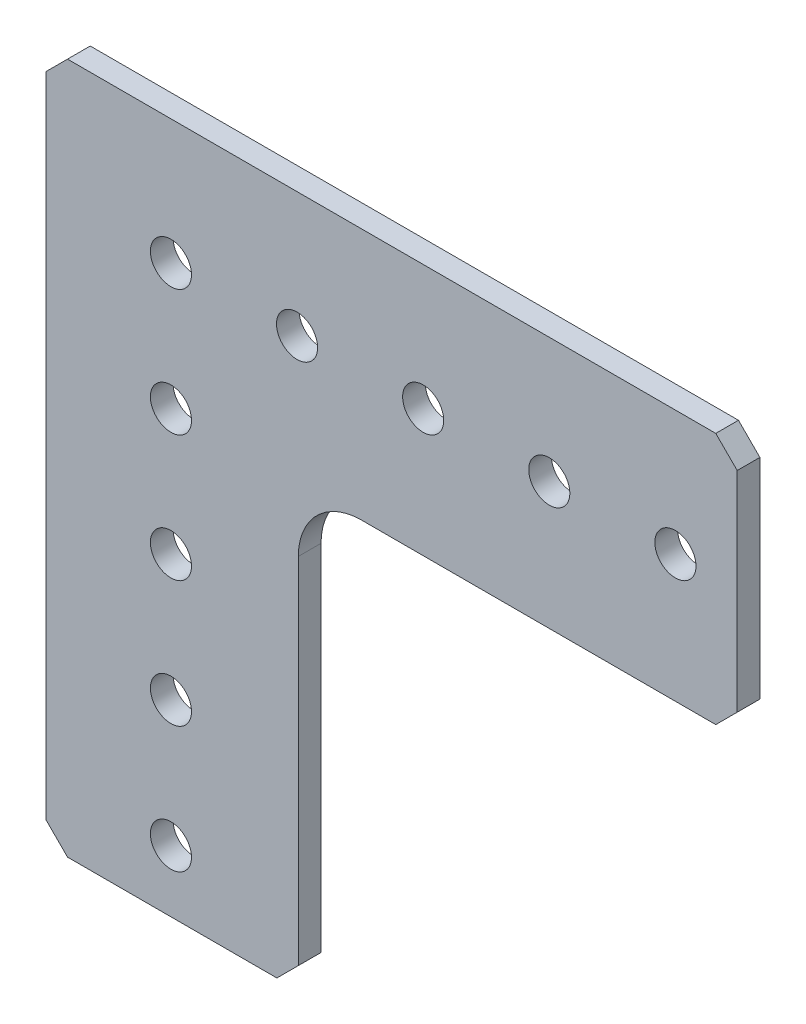
ISO-10303-21;
HEADER;
FILE_DESCRIPTION(('STEP AP214'),'2;1');
FILE_NAME('part.step','',(''),(''),'','','');
FILE_SCHEMA(('AUTOMOTIVE_DESIGN { 1 0 10303 214 1 1 1 1 }'));
ENDSEC;
DATA;
#1=APPLICATION_CONTEXT('core data for automotive mechanical design processes');
#2=APPLICATION_PROTOCOL_DEFINITION('international standard','automotive_design',2000,#1);
#3=PRODUCT_CONTEXT('',#1,'mechanical');
#4=PRODUCT('Part','Part','',(#3));
#5=PRODUCT_RELATED_PRODUCT_CATEGORY('part','',(#4));
#6=PRODUCT_DEFINITION_FORMATION('','',#4);
#7=PRODUCT_DEFINITION_CONTEXT('part definition',#1,'design');
#8=PRODUCT_DEFINITION('design','',#6,#7);
#9=PRODUCT_DEFINITION_SHAPE('','',#8);
#10=(LENGTH_UNIT() NAMED_UNIT(*) SI_UNIT(.MILLI.,.METRE.));
#11=(NAMED_UNIT(*) PLANE_ANGLE_UNIT() SI_UNIT($,.RADIAN.));
#12=(NAMED_UNIT(*) SI_UNIT($,.STERADIAN.) SOLID_ANGLE_UNIT());
#13=UNCERTAINTY_MEASURE_WITH_UNIT(LENGTH_MEASURE(1.E-05),#10,'distance_accuracy_value','');
#14=(GEOMETRIC_REPRESENTATION_CONTEXT(3) GLOBAL_UNCERTAINTY_ASSIGNED_CONTEXT((#13)) GLOBAL_UNIT_ASSIGNED_CONTEXT((#10,
#11,#12)) REPRESENTATION_CONTEXT('',''));
#15=CARTESIAN_POINT('',(0.,0.,0.));
#16=DIRECTION('',(0.,0.,1.));
#17=DIRECTION('',(1.,0.,0.));
#18=AXIS2_PLACEMENT_3D('',#15,#16,#17);
#19=CARTESIAN_POINT('',(-12.573,10.414,2.286));
#20=DIRECTION('',(-0.70710678118655,0.707106781186545,0.));
#21=DIRECTION('',(-0.707106781186545,-0.70710678118655,0.));
#22=AXIS2_PLACEMENT_3D('',#19,#20,#21);
#23=PLANE('',#22);
#24=DIRECTION('',(0.707106781186545,0.70710678118655,0.));
#25=VECTOR('',#24,1.);
#26=CARTESIAN_POINT('',(-12.573,10.414,0.));
#27=LINE('',#26,#25);
#28=CARTESIAN_POINT('',(-12.573,10.414,0.));
#29=VERTEX_POINT('',#28);
#30=CARTESIAN_POINT('',(-10.414,12.573,0.));
#31=VERTEX_POINT('',#30);
#32=EDGE_CURVE('E156',#29,#31,#27,.T.);
#33=ORIENTED_EDGE('',*,*,#32,.F.);
#34=DIRECTION('',(0.,0.,-1.));
#35=VECTOR('',#34,1.);
#36=CARTESIAN_POINT('',(-12.573,10.414,2.286));
#37=LINE('',#36,#35);
#38=CARTESIAN_POINT('',(-12.573,10.414,2.286));
#39=VERTEX_POINT('',#38);
#40=EDGE_CURVE('E11',#39,#29,#37,.T.);
#41=ORIENTED_EDGE('',*,*,#40,.F.);
#42=DIRECTION('',(0.707106781186545,0.70710678118655,0.));
#43=VECTOR('',#42,1.);
#44=CARTESIAN_POINT('',(-12.573,10.414,2.286));
#45=LINE('',#44,#43);
#46=CARTESIAN_POINT('',(-10.414,12.573,2.286));
#47=VERTEX_POINT('',#46);
#48=EDGE_CURVE('E189',#39,#47,#45,.T.);
#49=ORIENTED_EDGE('',*,*,#48,.T.);
#50=DIRECTION('',(0.,0.,-1.));
#51=VECTOR('',#50,1.);
#52=CARTESIAN_POINT('',(-10.414,12.573,2.286));
#53=LINE('',#52,#51);
#54=EDGE_CURVE('E38',#47,#31,#53,.T.);
#55=ORIENTED_EDGE('',*,*,#54,.T.);
#56=EDGE_LOOP('',(#33,#41,#49,#55));
#57=FACE_BOUND('',#56,.T.);
#58=ADVANCED_FACE('F35',(#57),#23,.T.);
#59=CARTESIAN_POINT('',(-12.573,-54.864,2.286));
#60=DIRECTION('',(-1.,0.,0.));
#61=DIRECTION('',(0.,-1.,0.));
#62=AXIS2_PLACEMENT_3D('',#59,#60,#61);
#63=PLANE('',#62);
#64=DIRECTION('',(0.,1.,0.));
#65=VECTOR('',#64,1.);
#66=CARTESIAN_POINT('',(-12.573,-54.864,0.));
#67=LINE('',#66,#65);
#68=CARTESIAN_POINT('',(-12.573,-54.864,0.));
#69=VERTEX_POINT('',#68);
#70=EDGE_CURVE('E187',#69,#29,#67,.T.);
#71=ORIENTED_EDGE('',*,*,#70,.F.);
#72=DIRECTION('',(0.,0.,-1.));
#73=VECTOR('',#72,1.);
#74=CARTESIAN_POINT('',(-12.573,-54.864,2.286));
#75=LINE('',#74,#73);
#76=CARTESIAN_POINT('',(-12.573,-54.864,2.286));
#77=VERTEX_POINT('',#76);
#78=EDGE_CURVE('E44',#77,#69,#75,.T.);
#79=ORIENTED_EDGE('',*,*,#78,.F.);
#80=DIRECTION('',(0.,1.,0.));
#81=VECTOR('',#80,1.);
#82=CARTESIAN_POINT('',(-12.573,-54.864,2.286));
#83=LINE('',#82,#81);
#84=EDGE_CURVE('E146',#77,#39,#83,.T.);
#85=ORIENTED_EDGE('',*,*,#84,.T.);
#86=ORIENTED_EDGE('',*,*,#40,.T.);
#87=EDGE_LOOP('',(#71,#79,#85,#86));
#88=FACE_BOUND('',#87,.T.);
#89=ADVANCED_FACE('F209',(#88),#63,.T.);
#90=CARTESIAN_POINT('',(-10.414,-57.023,2.286));
#91=DIRECTION('',(-0.70710678118654,-0.707106781186555,0.));
#92=DIRECTION('',(0.707106781186555,-0.70710678118654,0.));
#93=AXIS2_PLACEMENT_3D('',#90,#91,#92);
#94=PLANE('',#93);
#95=DIRECTION('',(-0.707106781186555,0.70710678118654,0.));
#96=VECTOR('',#95,1.);
#97=CARTESIAN_POINT('',(-10.414,-57.023,0.));
#98=LINE('',#97,#96);
#99=CARTESIAN_POINT('',(-10.414,-57.023,0.));
#100=VERTEX_POINT('',#99);
#101=EDGE_CURVE('E133',#100,#69,#98,.T.);
#102=ORIENTED_EDGE('',*,*,#101,.F.);
#103=DIRECTION('',(0.,0.,-1.));
#104=VECTOR('',#103,1.);
#105=CARTESIAN_POINT('',(-10.414,-57.023,2.286));
#106=LINE('',#105,#104);
#107=CARTESIAN_POINT('',(-10.414,-57.023,2.286));
#108=VERTEX_POINT('',#107);
#109=EDGE_CURVE('E128',#108,#100,#106,.T.);
#110=ORIENTED_EDGE('',*,*,#109,.F.);
#111=DIRECTION('',(-0.707106781186555,0.70710678118654,0.));
#112=VECTOR('',#111,1.);
#113=CARTESIAN_POINT('',(-10.414,-57.023,2.286));
#114=LINE('',#113,#112);
#115=EDGE_CURVE('E131',#108,#77,#114,.T.);
#116=ORIENTED_EDGE('',*,*,#115,.T.);
#117=ORIENTED_EDGE('',*,*,#78,.T.);
#118=EDGE_LOOP('',(#102,#110,#116,#117));
#119=FACE_BOUND('',#118,.T.);
#120=ADVANCED_FACE('F130',(#119),#94,.T.);
#121=CARTESIAN_POINT('',(10.668,-57.023,2.286));
#122=DIRECTION('',(0.,-1.,0.));
#123=DIRECTION('',(1.,0.,0.));
#124=AXIS2_PLACEMENT_3D('',#121,#122,#123);
#125=PLANE('',#124);
#126=DIRECTION('',(-1.,0.,0.));
#127=VECTOR('',#126,1.);
#128=CARTESIAN_POINT('',(10.668,-57.023,0.));
#129=LINE('',#128,#127);
#130=CARTESIAN_POINT('',(10.668,-57.023,0.));
#131=VERTEX_POINT('',#130);
#132=EDGE_CURVE('E184',#131,#100,#129,.T.);
#133=ORIENTED_EDGE('',*,*,#132,.F.);
#134=DIRECTION('',(0.,0.,-1.));
#135=VECTOR('',#134,1.);
#136=CARTESIAN_POINT('',(10.668,-57.023,2.286));
#137=LINE('',#136,#135);
#138=CARTESIAN_POINT('',(10.668,-57.023,2.286));
#139=VERTEX_POINT('',#138);
#140=EDGE_CURVE('E138',#139,#131,#137,.T.);
#141=ORIENTED_EDGE('',*,*,#140,.F.);
#142=DIRECTION('',(-1.,0.,0.));
#143=VECTOR('',#142,1.);
#144=CARTESIAN_POINT('',(10.668,-57.023,2.286));
#145=LINE('',#144,#143);
#146=EDGE_CURVE('E144',#139,#108,#145,.T.);
#147=ORIENTED_EDGE('',*,*,#146,.T.);
#148=ORIENTED_EDGE('',*,*,#109,.T.);
#149=EDGE_LOOP('',(#133,#141,#147,#148));
#150=FACE_BOUND('',#149,.T.);
#151=ADVANCED_FACE('F148',(#150),#125,.T.);
#152=CARTESIAN_POINT('',(12.827,-54.864,2.286));
#153=DIRECTION('',(0.707106781186551,-0.707106781186544,0.));
#154=DIRECTION('',(0.707106781186544,0.707106781186551,0.));
#155=AXIS2_PLACEMENT_3D('',#152,#153,#154);
#156=PLANE('',#155);
#157=DIRECTION('',(-0.707106781186544,-0.707106781186551,0.));
#158=VECTOR('',#157,1.);
#159=CARTESIAN_POINT('',(12.827,-54.864,0.));
#160=LINE('',#159,#158);
#161=CARTESIAN_POINT('',(12.827,-54.864,0.));
#162=VERTEX_POINT('',#161);
#163=EDGE_CURVE('E181',#162,#131,#160,.T.);
#164=ORIENTED_EDGE('',*,*,#163,.F.);
#165=DIRECTION('',(0.,0.,-1.));
#166=VECTOR('',#165,1.);
#167=CARTESIAN_POINT('',(12.827,-54.864,2.286));
#168=LINE('',#167,#166);
#169=CARTESIAN_POINT('',(12.827,-54.864,2.286));
#170=VERTEX_POINT('',#169);
#171=EDGE_CURVE('E193',#170,#162,#168,.T.);
#172=ORIENTED_EDGE('',*,*,#171,.F.);
#173=DIRECTION('',(-0.707106781186544,-0.707106781186551,0.));
#174=VECTOR('',#173,1.);
#175=CARTESIAN_POINT('',(12.827,-54.864,2.286));
#176=LINE('',#175,#174);
#177=EDGE_CURVE('E149',#170,#139,#176,.T.);
#178=ORIENTED_EDGE('',*,*,#177,.T.);
#179=ORIENTED_EDGE('',*,*,#140,.T.);
#180=EDGE_LOOP('',(#164,#172,#178,#179));
#181=FACE_BOUND('',#180,.T.);
#182=ADVANCED_FACE('F222',(#181),#156,.T.);
#183=CARTESIAN_POINT('',(12.827,-19.177,2.286));
#184=DIRECTION('',(1.,0.,0.));
#185=DIRECTION('',(0.,1.,0.));
#186=AXIS2_PLACEMENT_3D('',#183,#184,#185);
#187=PLANE('',#186);
#188=DIRECTION('',(0.,-1.,0.));
#189=VECTOR('',#188,1.);
#190=CARTESIAN_POINT('',(12.827,-19.177,0.));
#191=LINE('',#190,#189);
#192=CARTESIAN_POINT('',(12.827,-19.177,0.));
#193=VERTEX_POINT('',#192);
#194=EDGE_CURVE('E178',#193,#162,#191,.T.);
#195=ORIENTED_EDGE('',*,*,#194,.F.);
#196=DIRECTION('',(0.,0.,-1.));
#197=VECTOR('',#196,1.);
#198=CARTESIAN_POINT('',(12.827,-19.177,2.286));
#199=LINE('',#198,#197);
#200=CARTESIAN_POINT('',(12.827,-19.177,2.286));
#201=VERTEX_POINT('',#200);
#202=EDGE_CURVE('E195',#201,#193,#199,.T.);
#203=ORIENTED_EDGE('',*,*,#202,.F.);
#204=DIRECTION('',(0.,-1.,0.));
#205=VECTOR('',#204,1.);
#206=CARTESIAN_POINT('',(12.827,-19.177,2.286));
#207=LINE('',#206,#205);
#208=EDGE_CURVE('E151',#201,#170,#207,.T.);
#209=ORIENTED_EDGE('',*,*,#208,.T.);
#210=ORIENTED_EDGE('',*,*,#171,.T.);
#211=EDGE_LOOP('',(#195,#203,#209,#210));
#212=FACE_BOUND('',#211,.T.);
#213=ADVANCED_FACE('F225',(#212),#187,.T.);
#214=CARTESIAN_POINT('',(19.177,-19.177,2.286));
#215=DIRECTION('',(0.,0.,-1.));
#216=DIRECTION('',(-1.,0.,0.));
#217=AXIS2_PLACEMENT_3D('',#214,#215,#216);
#218=CYLINDRICAL_SURFACE('',#217,6.35);
#219=CARTESIAN_POINT('',(19.177,-19.177,0.));
#220=DIRECTION('',(0.,0.,1.));
#221=DIRECTION('',(1.,0.,0.));
#222=AXIS2_PLACEMENT_3D('',#219,#220,#221);
#223=CIRCLE('',#222,6.35);
#224=CARTESIAN_POINT('',(19.177,-12.827,0.));
#225=VERTEX_POINT('',#224);
#226=EDGE_CURVE('E175',#225,#193,#223,.T.);
#227=ORIENTED_EDGE('',*,*,#226,.F.);
#228=DIRECTION('',(0.,0.,-1.));
#229=VECTOR('',#228,1.);
#230=CARTESIAN_POINT('',(19.177,-12.827,2.286));
#231=LINE('',#230,#229);
#232=CARTESIAN_POINT('',(19.177,-12.827,2.286));
#233=VERTEX_POINT('',#232);
#234=EDGE_CURVE('E197',#233,#225,#231,.T.);
#235=ORIENTED_EDGE('',*,*,#234,.F.);
#236=CARTESIAN_POINT('',(19.177,-19.177,2.286));
#237=DIRECTION('',(0.,0.,1.));
#238=DIRECTION('',(1.,0.,0.));
#239=AXIS2_PLACEMENT_3D('',#236,#237,#238);
#240=CIRCLE('',#239,6.35);
#241=EDGE_CURVE('E369',#233,#201,#240,.T.);
#242=ORIENTED_EDGE('',*,*,#241,.T.);
#243=ORIENTED_EDGE('',*,*,#202,.T.);
#244=EDGE_LOOP('',(#227,#235,#242,#243));
#245=FACE_BOUND('',#244,.T.);
#246=ADVANCED_FACE('F229',(#245),#218,.F.);
#247=CARTESIAN_POINT('',(54.864,-12.827,2.286));
#248=DIRECTION('',(0.,-1.,0.));
#249=DIRECTION('',(1.,0.,0.));
#250=AXIS2_PLACEMENT_3D('',#247,#248,#249);
#251=PLANE('',#250);
#252=DIRECTION('',(-1.,0.,0.));
#253=VECTOR('',#252,1.);
#254=CARTESIAN_POINT('',(54.864,-12.827,0.));
#255=LINE('',#254,#253);
#256=CARTESIAN_POINT('',(54.864,-12.827,0.));
#257=VERTEX_POINT('',#256);
#258=EDGE_CURVE('E172',#257,#225,#255,.T.);
#259=ORIENTED_EDGE('',*,*,#258,.F.);
#260=DIRECTION('',(0.,0.,-1.));
#261=VECTOR('',#260,1.);
#262=CARTESIAN_POINT('',(54.864,-12.827,2.286));
#263=LINE('',#262,#261);
#264=CARTESIAN_POINT('',(54.864,-12.827,2.286));
#265=VERTEX_POINT('',#264);
#266=EDGE_CURVE('E199',#265,#257,#263,.T.);
#267=ORIENTED_EDGE('',*,*,#266,.F.);
#268=DIRECTION('',(-1.,0.,0.));
#269=VECTOR('',#268,1.);
#270=CARTESIAN_POINT('',(54.864,-12.827,2.286));
#271=LINE('',#270,#269);
#272=EDGE_CURVE('E366',#265,#233,#271,.T.);
#273=ORIENTED_EDGE('',*,*,#272,.T.);
#274=ORIENTED_EDGE('',*,*,#234,.T.);
#275=EDGE_LOOP('',(#259,#267,#273,#274));
#276=FACE_BOUND('',#275,.T.);
#277=ADVANCED_FACE('F233',(#276),#251,.T.);
#278=CARTESIAN_POINT('',(57.023,-10.668,2.286));
#279=DIRECTION('',(0.707106781186546,-0.707106781186549,0.));
#280=DIRECTION('',(0.707106781186549,0.707106781186546,0.));
#281=AXIS2_PLACEMENT_3D('',#278,#279,#280);
#282=PLANE('',#281);
#283=DIRECTION('',(-0.707106781186549,-0.707106781186546,0.));
#284=VECTOR('',#283,1.);
#285=CARTESIAN_POINT('',(57.023,-10.668,0.));
#286=LINE('',#285,#284);
#287=CARTESIAN_POINT('',(57.023,-10.668,0.));
#288=VERTEX_POINT('',#287);
#289=EDGE_CURVE('E169',#288,#257,#286,.T.);
#290=ORIENTED_EDGE('',*,*,#289,.F.);
#291=DIRECTION('',(0.,0.,-1.));
#292=VECTOR('',#291,1.);
#293=CARTESIAN_POINT('',(57.023,-10.668,2.286));
#294=LINE('',#293,#292);
#295=CARTESIAN_POINT('',(57.023,-10.668,2.286));
#296=VERTEX_POINT('',#295);
#297=EDGE_CURVE('E201',#296,#288,#294,.T.);
#298=ORIENTED_EDGE('',*,*,#297,.F.);
#299=DIRECTION('',(-0.707106781186549,-0.707106781186546,0.));
#300=VECTOR('',#299,1.);
#301=CARTESIAN_POINT('',(57.023,-10.668,2.286));
#302=LINE('',#301,#300);
#303=EDGE_CURVE('E363',#296,#265,#302,.T.);
#304=ORIENTED_EDGE('',*,*,#303,.T.);
#305=ORIENTED_EDGE('',*,*,#266,.T.);
#306=EDGE_LOOP('',(#290,#298,#304,#305));
#307=FACE_BOUND('',#306,.T.);
#308=ADVANCED_FACE('F237',(#307),#282,.T.);
#309=CARTESIAN_POINT('',(57.023,10.414,2.286));
#310=DIRECTION('',(1.,0.,0.));
#311=DIRECTION('',(0.,1.,0.));
#312=AXIS2_PLACEMENT_3D('',#309,#310,#311);
#313=PLANE('',#312);
#314=DIRECTION('',(0.,-1.,0.));
#315=VECTOR('',#314,1.);
#316=CARTESIAN_POINT('',(57.023,10.414,0.));
#317=LINE('',#316,#315);
#318=CARTESIAN_POINT('',(57.023,10.414,0.));
#319=VERTEX_POINT('',#318);
#320=EDGE_CURVE('E166',#319,#288,#317,.T.);
#321=ORIENTED_EDGE('',*,*,#320,.F.);
#322=DIRECTION('',(0.,0.,-1.));
#323=VECTOR('',#322,1.);
#324=CARTESIAN_POINT('',(57.023,10.414,2.286));
#325=LINE('',#324,#323);
#326=CARTESIAN_POINT('',(57.023,10.414,2.286));
#327=VERTEX_POINT('',#326);
#328=EDGE_CURVE('E203',#327,#319,#325,.T.);
#329=ORIENTED_EDGE('',*,*,#328,.F.);
#330=DIRECTION('',(0.,-1.,0.));
#331=VECTOR('',#330,1.);
#332=CARTESIAN_POINT('',(57.023,10.414,2.286));
#333=LINE('',#332,#331);
#334=EDGE_CURVE('E360',#327,#296,#333,.T.);
#335=ORIENTED_EDGE('',*,*,#334,.T.);
#336=ORIENTED_EDGE('',*,*,#297,.T.);
#337=EDGE_LOOP('',(#321,#329,#335,#336));
#338=FACE_BOUND('',#337,.T.);
#339=ADVANCED_FACE('F241',(#338),#313,.T.);
#340=CARTESIAN_POINT('',(54.864,12.573,2.286));
#341=DIRECTION('',(0.707106781186542,0.707106781186554,0.));
#342=DIRECTION('',(-0.707106781186554,0.707106781186542,0.));
#343=AXIS2_PLACEMENT_3D('',#340,#341,#342);
#344=PLANE('',#343);
#345=DIRECTION('',(0.707106781186553,-0.707106781186541,0.));
#346=VECTOR('',#345,1.);
#347=CARTESIAN_POINT('',(54.864,12.573,0.));
#348=LINE('',#347,#346);
#349=CARTESIAN_POINT('',(54.864,12.573,0.));
#350=VERTEX_POINT('',#349);
#351=EDGE_CURVE('E163',#350,#319,#348,.T.);
#352=ORIENTED_EDGE('',*,*,#351,.F.);
#353=DIRECTION('',(0.,0.,-1.));
#354=VECTOR('',#353,1.);
#355=CARTESIAN_POINT('',(54.864,12.573,2.286));
#356=LINE('',#355,#354);
#357=CARTESIAN_POINT('',(54.864,12.573,2.286));
#358=VERTEX_POINT('',#357);
#359=EDGE_CURVE('E204',#358,#350,#356,.T.);
#360=ORIENTED_EDGE('',*,*,#359,.F.);
#361=DIRECTION('',(0.707106781186553,-0.707106781186541,0.));
#362=VECTOR('',#361,1.);
#363=CARTESIAN_POINT('',(54.864,12.573,2.286));
#364=LINE('',#363,#362);
#365=EDGE_CURVE('E357',#358,#327,#364,.T.);
#366=ORIENTED_EDGE('',*,*,#365,.T.);
#367=ORIENTED_EDGE('',*,*,#328,.T.);
#368=EDGE_LOOP('',(#352,#360,#366,#367));
#369=FACE_BOUND('',#368,.T.);
#370=ADVANCED_FACE('F245',(#369),#344,.T.);
#371=CARTESIAN_POINT('',(-10.414,12.573,2.286));
#372=DIRECTION('',(0.,1.,0.));
#373=DIRECTION('',(0.,0.,1.));
#374=AXIS2_PLACEMENT_3D('',#371,#372,#373);
#375=PLANE('',#374);
#376=DIRECTION('',(1.,0.,0.));
#377=VECTOR('',#376,1.);
#378=CARTESIAN_POINT('',(-10.414,12.573,0.));
#379=LINE('',#378,#377);
#380=EDGE_CURVE('E159',#31,#350,#379,.T.);
#381=ORIENTED_EDGE('',*,*,#380,.F.);
#382=ORIENTED_EDGE('',*,*,#54,.F.);
#383=DIRECTION('',(1.,0.,0.));
#384=VECTOR('',#383,1.);
#385=CARTESIAN_POINT('',(-10.414,12.573,2.286));
#386=LINE('',#385,#384);
#387=EDGE_CURVE('E355',#47,#358,#386,.T.);
#388=ORIENTED_EDGE('',*,*,#387,.T.);
#389=ORIENTED_EDGE('',*,*,#359,.T.);
#390=EDGE_LOOP('',(#381,#382,#388,#389));
#391=FACE_BOUND('',#390,.T.);
#392=ADVANCED_FACE('F206',(#391),#375,.T.);
#393=CARTESIAN_POINT('',(19.177,-19.177,2.286));
#394=DIRECTION('',(0.,0.,1.));
#395=DIRECTION('',(1.,0.,0.));
#396=AXIS2_PLACEMENT_3D('',#393,#394,#395);
#397=PLANE('',#396);
#398=CARTESIAN_POINT('',(50.8,0.,2.286));
#399=DIRECTION('',(0.,0.,-1.));
#400=DIRECTION('',(1.,0.,0.));
#401=AXIS2_PLACEMENT_3D('',#398,#399,#400);
#402=CIRCLE('',#401,2.0701);
#403=CARTESIAN_POINT('',(52.8701,0.,2.286));
#404=VERTEX_POINT('',#403);
#405=EDGE_CURVE('E300',#404,#404,#402,.T.);
#406=ORIENTED_EDGE('',*,*,#405,.T.);
#407=EDGE_LOOP('',(#406));
#408=FACE_BOUND('',#407,.T.);
#409=CARTESIAN_POINT('',(3.9907631702977E-13,-38.1,2.286));
#410=DIRECTION('',(0.,0.,-1.));
#411=DIRECTION('',(1.,0.,0.));
#412=AXIS2_PLACEMENT_3D('',#409,#410,#411);
#413=CIRCLE('',#412,2.0701);
#414=CARTESIAN_POINT('',(2.0701000000004,-38.1,2.286));
#415=VERTEX_POINT('',#414);
#416=EDGE_CURVE('E308',#415,#415,#413,.T.);
#417=ORIENTED_EDGE('',*,*,#416,.T.);
#418=EDGE_LOOP('',(#417));
#419=FACE_BOUND('',#418,.T.);
#420=CARTESIAN_POINT('',(1.33025439009923E-13,-12.7,2.286));
#421=DIRECTION('',(0.,0.,-1.));
#422=DIRECTION('',(1.,0.,0.));
#423=AXIS2_PLACEMENT_3D('',#420,#421,#422);
#424=CIRCLE('',#423,2.0701);
#425=CARTESIAN_POINT('',(2.07010000000013,-12.7,2.286));
#426=VERTEX_POINT('',#425);
#427=EDGE_CURVE('E314',#426,#426,#424,.T.);
#428=ORIENTED_EDGE('',*,*,#427,.T.);
#429=EDGE_LOOP('',(#428));
#430=FACE_BOUND('',#429,.T.);
#431=CARTESIAN_POINT('',(25.4,3.54734504026462E-13,2.286));
#432=DIRECTION('',(0.,0.,-1.));
#433=DIRECTION('',(1.,0.,0.));
#434=AXIS2_PLACEMENT_3D('',#431,#432,#433);
#435=CIRCLE('',#434,2.0701);
#436=CARTESIAN_POINT('',(27.4701,3.54734504026462E-13,2.286));
#437=VERTEX_POINT('',#436);
#438=EDGE_CURVE('E320',#437,#437,#435,.T.);
#439=ORIENTED_EDGE('',*,*,#438,.T.);
#440=EDGE_LOOP('',(#439));
#441=FACE_BOUND('',#440,.T.);
#442=CARTESIAN_POINT('',(0.,0.,2.286));
#443=DIRECTION('',(0.,0.,-1.));
#444=DIRECTION('',(1.,0.,0.));
#445=AXIS2_PLACEMENT_3D('',#442,#443,#444);
#446=CIRCLE('',#445,2.0701);
#447=CARTESIAN_POINT('',(2.0701,0.,2.286));
#448=VERTEX_POINT('',#447);
#449=EDGE_CURVE('E326',#448,#448,#446,.T.);
#450=ORIENTED_EDGE('',*,*,#449,.T.);
#451=EDGE_LOOP('',(#450));
#452=FACE_BOUND('',#451,.T.);
#453=CARTESIAN_POINT('',(12.7,1.77367252013231E-13,2.286));
#454=DIRECTION('',(0.,0.,-1.));
#455=DIRECTION('',(1.,0.,0.));
#456=AXIS2_PLACEMENT_3D('',#453,#454,#455);
#457=CIRCLE('',#456,2.0701);
#458=CARTESIAN_POINT('',(14.7701,1.77367252013231E-13,2.286));
#459=VERTEX_POINT('',#458);
#460=EDGE_CURVE('E332',#459,#459,#457,.T.);
#461=ORIENTED_EDGE('',*,*,#460,.T.);
#462=EDGE_LOOP('',(#461));
#463=FACE_BOUND('',#462,.T.);
#464=CARTESIAN_POINT('',(38.1,0.,2.286));
#465=DIRECTION('',(0.,0.,-1.));
#466=DIRECTION('',(1.,0.,0.));
#467=AXIS2_PLACEMENT_3D('',#464,#465,#466);
#468=CIRCLE('',#467,2.0701);
#469=CARTESIAN_POINT('',(40.1701,0.,2.286));
#470=VERTEX_POINT('',#469);
#471=EDGE_CURVE('E338',#470,#470,#468,.T.);
#472=ORIENTED_EDGE('',*,*,#471,.T.);
#473=EDGE_LOOP('',(#472));
#474=FACE_BOUND('',#473,.T.);
#475=CARTESIAN_POINT('',(2.66050878019847E-13,-25.4,2.286));
#476=DIRECTION('',(0.,0.,-1.));
#477=DIRECTION('',(1.,0.,0.));
#478=AXIS2_PLACEMENT_3D('',#475,#476,#477);
#479=CIRCLE('',#478,2.0701);
#480=CARTESIAN_POINT('',(2.07010000000027,-25.4,2.286));
#481=VERTEX_POINT('',#480);
#482=EDGE_CURVE('E344',#481,#481,#479,.T.);
#483=ORIENTED_EDGE('',*,*,#482,.T.);
#484=EDGE_LOOP('',(#483));
#485=FACE_BOUND('',#484,.T.);
#486=CARTESIAN_POINT('',(0.,-50.8,2.286));
#487=DIRECTION('',(0.,0.,-1.));
#488=DIRECTION('',(1.,0.,0.));
#489=AXIS2_PLACEMENT_3D('',#486,#487,#488);
#490=CIRCLE('',#489,2.0701);
#491=CARTESIAN_POINT('',(2.07010000000001,-50.8,2.286));
#492=VERTEX_POINT('',#491);
#493=EDGE_CURVE('E160',#492,#492,#490,.T.);
#494=ORIENTED_EDGE('',*,*,#493,.T.);
#495=EDGE_LOOP('',(#494));
#496=FACE_BOUND('',#495,.T.);
#497=ORIENTED_EDGE('',*,*,#48,.F.);
#498=ORIENTED_EDGE('',*,*,#84,.F.);
#499=ORIENTED_EDGE('',*,*,#115,.F.);
#500=ORIENTED_EDGE('',*,*,#146,.F.);
#501=ORIENTED_EDGE('',*,*,#177,.F.);
#502=ORIENTED_EDGE('',*,*,#208,.F.);
#503=ORIENTED_EDGE('',*,*,#241,.F.);
#504=ORIENTED_EDGE('',*,*,#272,.F.);
#505=ORIENTED_EDGE('',*,*,#303,.F.);
#506=ORIENTED_EDGE('',*,*,#334,.F.);
#507=ORIENTED_EDGE('',*,*,#365,.F.);
#508=ORIENTED_EDGE('',*,*,#387,.F.);
#509=EDGE_LOOP('',(#497,#498,#499,#500,#501,#502,#503,#504,#505,#506,#507,#508));
#510=FACE_BOUND('',#509,.T.);
#511=ADVANCED_FACE('F142',(#408,#419,#430,#441,#452,#463,#474,#485,#496,#510),#397,.T.);
#512=CARTESIAN_POINT('',(19.177,-19.177,0.));
#513=DIRECTION('',(0.,0.,1.));
#514=DIRECTION('',(1.,0.,0.));
#515=AXIS2_PLACEMENT_3D('',#512,#513,#514);
#516=PLANE('',#515);
#517=CARTESIAN_POINT('',(50.8,0.,0.));
#518=DIRECTION('',(0.,0.,-1.));
#519=DIRECTION('',(1.,0.,0.));
#520=AXIS2_PLACEMENT_3D('',#517,#518,#519);
#521=CIRCLE('',#520,2.0701);
#522=CARTESIAN_POINT('',(52.8701,0.,0.));
#523=VERTEX_POINT('',#522);
#524=EDGE_CURVE('E303',#523,#523,#521,.T.);
#525=ORIENTED_EDGE('',*,*,#524,.F.);
#526=EDGE_LOOP('',(#525));
#527=FACE_BOUND('',#526,.T.);
#528=CARTESIAN_POINT('',(3.9907631702977E-13,-38.1,0.));
#529=DIRECTION('',(0.,0.,-1.));
#530=DIRECTION('',(1.,0.,0.));
#531=AXIS2_PLACEMENT_3D('',#528,#529,#530);
#532=CIRCLE('',#531,2.0701);
#533=CARTESIAN_POINT('',(2.0701000000004,-38.1,0.));
#534=VERTEX_POINT('',#533);
#535=EDGE_CURVE('E305',#534,#534,#532,.T.);
#536=ORIENTED_EDGE('',*,*,#535,.F.);
#537=EDGE_LOOP('',(#536));
#538=FACE_BOUND('',#537,.T.);
#539=CARTESIAN_POINT('',(1.33025439009923E-13,-12.7,0.));
#540=DIRECTION('',(0.,0.,-1.));
#541=DIRECTION('',(1.,0.,0.));
#542=AXIS2_PLACEMENT_3D('',#539,#540,#541);
#543=CIRCLE('',#542,2.0701);
#544=CARTESIAN_POINT('',(2.07010000000013,-12.7,0.));
#545=VERTEX_POINT('',#544);
#546=EDGE_CURVE('E311',#545,#545,#543,.T.);
#547=ORIENTED_EDGE('',*,*,#546,.F.);
#548=EDGE_LOOP('',(#547));
#549=FACE_BOUND('',#548,.T.);
#550=CARTESIAN_POINT('',(25.4,3.54734504026462E-13,0.));
#551=DIRECTION('',(0.,0.,-1.));
#552=DIRECTION('',(1.,0.,0.));
#553=AXIS2_PLACEMENT_3D('',#550,#551,#552);
#554=CIRCLE('',#553,2.0701);
#555=CARTESIAN_POINT('',(27.4701,3.54734504026462E-13,0.));
#556=VERTEX_POINT('',#555);
#557=EDGE_CURVE('E317',#556,#556,#554,.T.);
#558=ORIENTED_EDGE('',*,*,#557,.F.);
#559=EDGE_LOOP('',(#558));
#560=FACE_BOUND('',#559,.T.);
#561=CARTESIAN_POINT('',(0.,0.,0.));
#562=DIRECTION('',(0.,0.,-1.));
#563=DIRECTION('',(1.,0.,0.));
#564=AXIS2_PLACEMENT_3D('',#561,#562,#563);
#565=CIRCLE('',#564,2.0701);
#566=CARTESIAN_POINT('',(2.0701,0.,0.));
#567=VERTEX_POINT('',#566);
#568=EDGE_CURVE('E323',#567,#567,#565,.T.);
#569=ORIENTED_EDGE('',*,*,#568,.F.);
#570=EDGE_LOOP('',(#569));
#571=FACE_BOUND('',#570,.T.);
#572=CARTESIAN_POINT('',(12.7,1.77367252013231E-13,0.));
#573=DIRECTION('',(0.,0.,-1.));
#574=DIRECTION('',(1.,0.,0.));
#575=AXIS2_PLACEMENT_3D('',#572,#573,#574);
#576=CIRCLE('',#575,2.0701);
#577=CARTESIAN_POINT('',(14.7701,1.77367252013231E-13,0.));
#578=VERTEX_POINT('',#577);
#579=EDGE_CURVE('E329',#578,#578,#576,.T.);
#580=ORIENTED_EDGE('',*,*,#579,.F.);
#581=EDGE_LOOP('',(#580));
#582=FACE_BOUND('',#581,.T.);
#583=CARTESIAN_POINT('',(38.1,0.,0.));
#584=DIRECTION('',(0.,0.,-1.));
#585=DIRECTION('',(1.,0.,0.));
#586=AXIS2_PLACEMENT_3D('',#583,#584,#585);
#587=CIRCLE('',#586,2.0701);
#588=CARTESIAN_POINT('',(40.1701,0.,0.));
#589=VERTEX_POINT('',#588);
#590=EDGE_CURVE('E335',#589,#589,#587,.T.);
#591=ORIENTED_EDGE('',*,*,#590,.F.);
#592=EDGE_LOOP('',(#591));
#593=FACE_BOUND('',#592,.T.);
#594=CARTESIAN_POINT('',(2.66050878019847E-13,-25.4,0.));
#595=DIRECTION('',(0.,0.,-1.));
#596=DIRECTION('',(1.,0.,0.));
#597=AXIS2_PLACEMENT_3D('',#594,#595,#596);
#598=CIRCLE('',#597,2.0701);
#599=CARTESIAN_POINT('',(2.07010000000027,-25.4,0.));
#600=VERTEX_POINT('',#599);
#601=EDGE_CURVE('E341',#600,#600,#598,.T.);
#602=ORIENTED_EDGE('',*,*,#601,.F.);
#603=EDGE_LOOP('',(#602));
#604=FACE_BOUND('',#603,.T.);
#605=CARTESIAN_POINT('',(0.,-50.8,0.));
#606=DIRECTION('',(0.,0.,-1.));
#607=DIRECTION('',(1.,0.,0.));
#608=AXIS2_PLACEMENT_3D('',#605,#606,#607);
#609=CIRCLE('',#608,2.0701);
#610=CARTESIAN_POINT('',(2.07010000000001,-50.8,0.));
#611=VERTEX_POINT('',#610);
#612=EDGE_CURVE('E347',#611,#611,#609,.T.);
#613=ORIENTED_EDGE('',*,*,#612,.F.);
#614=EDGE_LOOP('',(#613));
#615=FACE_BOUND('',#614,.T.);
#616=ORIENTED_EDGE('',*,*,#32,.T.);
#617=ORIENTED_EDGE('',*,*,#380,.T.);
#618=ORIENTED_EDGE('',*,*,#351,.T.);
#619=ORIENTED_EDGE('',*,*,#320,.T.);
#620=ORIENTED_EDGE('',*,*,#289,.T.);
#621=ORIENTED_EDGE('',*,*,#258,.T.);
#622=ORIENTED_EDGE('',*,*,#226,.T.);
#623=ORIENTED_EDGE('',*,*,#194,.T.);
#624=ORIENTED_EDGE('',*,*,#163,.T.);
#625=ORIENTED_EDGE('',*,*,#132,.T.);
#626=ORIENTED_EDGE('',*,*,#101,.T.);
#627=ORIENTED_EDGE('',*,*,#70,.T.);
#628=EDGE_LOOP('',(#616,#617,#618,#619,#620,#621,#622,#623,#624,#625,#626,#627));
#629=FACE_BOUND('',#628,.T.);
#630=ADVANCED_FACE('F208',(#527,#538,#549,#560,#571,#582,#593,#604,#615,#629),#516,.F.);
#631=CARTESIAN_POINT('',(0.,-50.8,2.286));
#632=DIRECTION('',(0.,0.,-1.));
#633=DIRECTION('',(-1.,0.,0.));
#634=AXIS2_PLACEMENT_3D('',#631,#632,#633);
#635=CYLINDRICAL_SURFACE('',#634,2.0701);
#636=ORIENTED_EDGE('',*,*,#493,.F.);
#637=EDGE_LOOP('',(#636));
#638=FACE_BOUND('',#637,.T.);
#639=ORIENTED_EDGE('',*,*,#612,.T.);
#640=EDGE_LOOP('',(#639));
#641=FACE_BOUND('',#640,.T.);
#642=ADVANCED_FACE('F257',(#638,#641),#635,.F.);
#643=CARTESIAN_POINT('',(2.66050878019847E-13,-25.4,2.286));
#644=DIRECTION('',(0.,0.,-1.));
#645=DIRECTION('',(-1.,0.,0.));
#646=AXIS2_PLACEMENT_3D('',#643,#644,#645);
#647=CYLINDRICAL_SURFACE('',#646,2.0701);
#648=ORIENTED_EDGE('',*,*,#482,.F.);
#649=EDGE_LOOP('',(#648));
#650=FACE_BOUND('',#649,.T.);
#651=ORIENTED_EDGE('',*,*,#601,.T.);
#652=EDGE_LOOP('',(#651));
#653=FACE_BOUND('',#652,.T.);
#654=ADVANCED_FACE('F264',(#650,#653),#647,.F.);
#655=CARTESIAN_POINT('',(38.1,0.,2.286));
#656=DIRECTION('',(0.,0.,-1.));
#657=DIRECTION('',(-1.,0.,0.));
#658=AXIS2_PLACEMENT_3D('',#655,#656,#657);
#659=CYLINDRICAL_SURFACE('',#658,2.0701);
#660=ORIENTED_EDGE('',*,*,#471,.F.);
#661=EDGE_LOOP('',(#660));
#662=FACE_BOUND('',#661,.T.);
#663=ORIENTED_EDGE('',*,*,#590,.T.);
#664=EDGE_LOOP('',(#663));
#665=FACE_BOUND('',#664,.T.);
#666=ADVANCED_FACE('F268',(#662,#665),#659,.F.);
#667=CARTESIAN_POINT('',(12.7,1.77367252013231E-13,2.286));
#668=DIRECTION('',(0.,0.,-1.));
#669=DIRECTION('',(-1.,0.,0.));
#670=AXIS2_PLACEMENT_3D('',#667,#668,#669);
#671=CYLINDRICAL_SURFACE('',#670,2.0701);
#672=ORIENTED_EDGE('',*,*,#460,.F.);
#673=EDGE_LOOP('',(#672));
#674=FACE_BOUND('',#673,.T.);
#675=ORIENTED_EDGE('',*,*,#579,.T.);
#676=EDGE_LOOP('',(#675));
#677=FACE_BOUND('',#676,.T.);
#678=ADVANCED_FACE('F272',(#674,#677),#671,.F.);
#679=CARTESIAN_POINT('',(0.,0.,2.286));
#680=DIRECTION('',(0.,0.,-1.));
#681=DIRECTION('',(-1.,0.,0.));
#682=AXIS2_PLACEMENT_3D('',#679,#680,#681);
#683=CYLINDRICAL_SURFACE('',#682,2.0701);
#684=ORIENTED_EDGE('',*,*,#449,.F.);
#685=EDGE_LOOP('',(#684));
#686=FACE_BOUND('',#685,.T.);
#687=ORIENTED_EDGE('',*,*,#568,.T.);
#688=EDGE_LOOP('',(#687));
#689=FACE_BOUND('',#688,.T.);
#690=ADVANCED_FACE('F276',(#686,#689),#683,.F.);
#691=CARTESIAN_POINT('',(25.4,3.54734504026462E-13,2.286));
#692=DIRECTION('',(0.,0.,-1.));
#693=DIRECTION('',(-1.,0.,0.));
#694=AXIS2_PLACEMENT_3D('',#691,#692,#693);
#695=CYLINDRICAL_SURFACE('',#694,2.0701);
#696=ORIENTED_EDGE('',*,*,#438,.F.);
#697=EDGE_LOOP('',(#696));
#698=FACE_BOUND('',#697,.T.);
#699=ORIENTED_EDGE('',*,*,#557,.T.);
#700=EDGE_LOOP('',(#699));
#701=FACE_BOUND('',#700,.T.);
#702=ADVANCED_FACE('F280',(#698,#701),#695,.F.);
#703=CARTESIAN_POINT('',(1.33025439009923E-13,-12.7,2.286));
#704=DIRECTION('',(0.,0.,-1.));
#705=DIRECTION('',(-1.,0.,0.));
#706=AXIS2_PLACEMENT_3D('',#703,#704,#705);
#707=CYLINDRICAL_SURFACE('',#706,2.0701);
#708=ORIENTED_EDGE('',*,*,#427,.F.);
#709=EDGE_LOOP('',(#708));
#710=FACE_BOUND('',#709,.T.);
#711=ORIENTED_EDGE('',*,*,#546,.T.);
#712=EDGE_LOOP('',(#711));
#713=FACE_BOUND('',#712,.T.);
#714=ADVANCED_FACE('F284',(#710,#713),#707,.F.);
#715=CARTESIAN_POINT('',(3.9907631702977E-13,-38.1,2.286));
#716=DIRECTION('',(0.,0.,-1.));
#717=DIRECTION('',(-1.,0.,0.));
#718=AXIS2_PLACEMENT_3D('',#715,#716,#717);
#719=CYLINDRICAL_SURFACE('',#718,2.0701);
#720=ORIENTED_EDGE('',*,*,#416,.F.);
#721=EDGE_LOOP('',(#720));
#722=FACE_BOUND('',#721,.T.);
#723=ORIENTED_EDGE('',*,*,#535,.T.);
#724=EDGE_LOOP('',(#723));
#725=FACE_BOUND('',#724,.T.);
#726=ADVANCED_FACE('F288',(#722,#725),#719,.F.);
#727=CARTESIAN_POINT('',(50.8,0.,2.286));
#728=DIRECTION('',(0.,0.,-1.));
#729=DIRECTION('',(-1.,0.,0.));
#730=AXIS2_PLACEMENT_3D('',#727,#728,#729);
#731=CYLINDRICAL_SURFACE('',#730,2.0701);
#732=ORIENTED_EDGE('',*,*,#405,.F.);
#733=EDGE_LOOP('',(#732));
#734=FACE_BOUND('',#733,.T.);
#735=ORIENTED_EDGE('',*,*,#524,.T.);
#736=EDGE_LOOP('',(#735));
#737=FACE_BOUND('',#736,.T.);
#738=ADVANCED_FACE('F292',(#734,#737),#731,.F.);
#739=CLOSED_SHELL('',(#58,#89,#120,#151,#182,#213,#246,#277,#308,#339,#370,#392,#511,#630,#642,
#654,#666,#678,#690,#702,#714,#726,#738));
#740=MANIFOLD_SOLID_BREP('B2',#739);
#741=ADVANCED_BREP_SHAPE_REPRESENTATION('',(#18,#740),#14);
#742=SHAPE_DEFINITION_REPRESENTATION(#9,#741);
ENDSEC;
END-ISO-10303-21;
